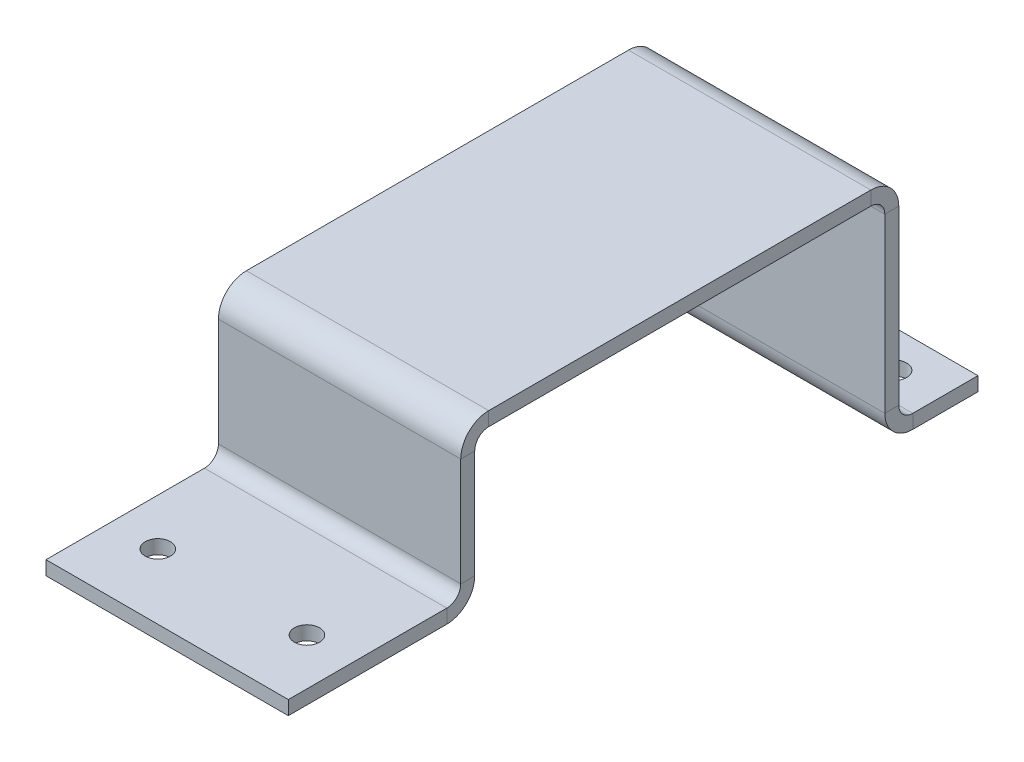
ISO-10303-21;
HEADER;
FILE_DESCRIPTION(('STEP AP214'),'2;1');
FILE_NAME('part.step','',(''),(''),'','','');
FILE_SCHEMA(('AUTOMOTIVE_DESIGN { 1 0 10303 214 1 1 1 1 }'));
ENDSEC;
DATA;
#1=APPLICATION_CONTEXT('core data for automotive mechanical design processes');
#2=APPLICATION_PROTOCOL_DEFINITION('international standard','automotive_design',2000,#1);
#3=PRODUCT_CONTEXT('',#1,'mechanical');
#4=PRODUCT('Part','Part','',(#3));
#5=PRODUCT_RELATED_PRODUCT_CATEGORY('part','',(#4));
#6=PRODUCT_DEFINITION_FORMATION('','',#4);
#7=PRODUCT_DEFINITION_CONTEXT('part definition',#1,'design');
#8=PRODUCT_DEFINITION('design','',#6,#7);
#9=PRODUCT_DEFINITION_SHAPE('','',#8);
#10=(LENGTH_UNIT() NAMED_UNIT(*) SI_UNIT(.MILLI.,.METRE.));
#11=(NAMED_UNIT(*) PLANE_ANGLE_UNIT() SI_UNIT($,.RADIAN.));
#12=(NAMED_UNIT(*) SI_UNIT($,.STERADIAN.) SOLID_ANGLE_UNIT());
#13=UNCERTAINTY_MEASURE_WITH_UNIT(LENGTH_MEASURE(1.E-05),#10,'distance_accuracy_value','');
#14=(GEOMETRIC_REPRESENTATION_CONTEXT(3) GLOBAL_UNCERTAINTY_ASSIGNED_CONTEXT((#13)) GLOBAL_UNIT_ASSIGNED_CONTEXT((#10,
#11,#12)) REPRESENTATION_CONTEXT('',''));
#15=CARTESIAN_POINT('',(0.,0.,0.));
#16=DIRECTION('',(0.,0.,1.));
#17=DIRECTION('',(1.,0.,0.));
#18=AXIS2_PLACEMENT_3D('',#15,#16,#17);
#19=CARTESIAN_POINT('',(0.,6.90000000000016,45.5000000000001));
#20=DIRECTION('',(1.,0.,0.));
#21=DIRECTION('',(0.,0.,-1.));
#22=AXIS2_PLACEMENT_3D('',#19,#20,#21);
#23=PLANE('',#22);
#24=DIRECTION('',(0.,0.,-1.));
#25=VECTOR('',#24,1.);
#26=CARTESIAN_POINT('',(0.,9.90000000000016,45.5000000000001));
#27=LINE('',#26,#25);
#28=CARTESIAN_POINT('',(0.,9.90000000000016,45.5000000000001));
#29=VERTEX_POINT('',#28);
#30=CARTESIAN_POINT('',(0.,9.90000000000017,44.0000000000001));
#31=VERTEX_POINT('',#30);
#32=EDGE_CURVE('E344',#29,#31,#27,.T.);
#33=ORIENTED_EDGE('',*,*,#32,.F.);
#34=DIRECTION('',(0.,-1.,0.));
#35=VECTOR('',#34,1.);
#36=CARTESIAN_POINT('',(0.,3.18995902880593E-13,45.5000000000002));
#37=LINE('',#36,#35);
#38=CARTESIAN_POINT('',(0.,21.5000000000002,45.5));
#39=VERTEX_POINT('',#38);
#40=EDGE_CURVE('E355',#39,#29,#37,.T.);
#41=ORIENTED_EDGE('',*,*,#40,.F.);
#42=DIRECTION('',(0.,0.,-1.));
#43=VECTOR('',#42,1.);
#44=CARTESIAN_POINT('',(0.,21.5000000000002,44.));
#45=LINE('',#44,#43);
#46=CARTESIAN_POINT('',(0.,21.5000000000002,44.));
#47=VERTEX_POINT('',#46);
#48=EDGE_CURVE('E370',#47,#39,#45,.F.);
#49=ORIENTED_EDGE('',*,*,#48,.F.);
#50=DIRECTION('',(0.,1.,0.));
#51=VECTOR('',#50,1.);
#52=CARTESIAN_POINT('',(0.,6.90000000000015,44.0000000000001));
#53=LINE('',#52,#51);
#54=EDGE_CURVE('E362',#47,#31,#53,.F.);
#55=ORIENTED_EDGE('',*,*,#54,.T.);
#56=EDGE_LOOP('',(#33,#41,#49,#55));
#57=FACE_BOUND('',#56,.T.);
#58=ADVANCED_FACE('F128',(#57),#23,.F.);
#59=CARTESIAN_POINT('',(26.,23.0000000000002,45.5));
#60=DIRECTION('',(-1.,0.,0.));
#61=DIRECTION('',(0.,0.,1.));
#62=AXIS2_PLACEMENT_3D('',#59,#60,#61);
#63=PLANE('',#62);
#64=DIRECTION('',(0.,0.,-1.));
#65=VECTOR('',#64,1.);
#66=CARTESIAN_POINT('',(26.,9.90000000000016,45.5000000000001));
#67=LINE('',#66,#65);
#68=CARTESIAN_POINT('',(26.,9.90000000000016,45.5000000000001));
#69=VERTEX_POINT('',#68);
#70=CARTESIAN_POINT('',(26.,9.90000000000015,44.0000000000001));
#71=VERTEX_POINT('',#70);
#72=EDGE_CURVE('E329',#69,#71,#67,.T.);
#73=ORIENTED_EDGE('',*,*,#72,.T.);
#74=DIRECTION('',(0.,-1.,0.));
#75=VECTOR('',#74,1.);
#76=CARTESIAN_POINT('',(26.,23.0000000000002,44.));
#77=LINE('',#76,#75);
#78=CARTESIAN_POINT('',(26.,21.5000000000002,44.));
#79=VERTEX_POINT('',#78);
#80=EDGE_CURVE('E359',#71,#79,#77,.F.);
#81=ORIENTED_EDGE('',*,*,#80,.T.);
#82=DIRECTION('',(0.,0.,-1.));
#83=VECTOR('',#82,1.);
#84=CARTESIAN_POINT('',(26.,21.5000000000002,45.5));
#85=LINE('',#84,#83);
#86=CARTESIAN_POINT('',(26.,21.5000000000002,45.5));
#87=VERTEX_POINT('',#86);
#88=EDGE_CURVE('E347',#79,#87,#85,.F.);
#89=ORIENTED_EDGE('',*,*,#88,.T.);
#90=DIRECTION('',(0.,1.,0.));
#91=VECTOR('',#90,1.);
#92=CARTESIAN_POINT('',(26.,3.18995902880593E-13,45.5000000000002));
#93=LINE('',#92,#91);
#94=EDGE_CURVE('E351',#69,#87,#93,.T.);
#95=ORIENTED_EDGE('',*,*,#94,.F.);
#96=EDGE_LOOP('',(#73,#81,#89,#95));
#97=FACE_BOUND('',#96,.T.);
#98=ADVANCED_FACE('F632',(#97),#63,.F.);
#99=CARTESIAN_POINT('',(0.,3.18995902880593E-13,45.5000000000002));
#100=DIRECTION('',(0.,0.,-1.));
#101=DIRECTION('',(0.,1.,0.));
#102=AXIS2_PLACEMENT_3D('',#99,#100,#101);
#103=PLANE('',#102);
#104=DIRECTION('',(1.,0.,0.));
#105=VECTOR('',#104,1.);
#106=CARTESIAN_POINT('',(26.,9.90000000000016,45.5000000000001));
#107=LINE('',#106,#105);
#108=EDGE_CURVE('E337',#69,#29,#107,.F.);
#109=ORIENTED_EDGE('',*,*,#108,.F.);
#110=ORIENTED_EDGE('',*,*,#94,.T.);
#111=DIRECTION('',(-1.,0.,0.));
#112=VECTOR('',#111,1.);
#113=CARTESIAN_POINT('',(26.,21.5000000000002,45.5));
#114=LINE('',#113,#112);
#115=EDGE_CURVE('E366',#39,#87,#114,.F.);
#116=ORIENTED_EDGE('',*,*,#115,.F.);
#117=ORIENTED_EDGE('',*,*,#40,.T.);
#118=EDGE_LOOP('',(#109,#110,#116,#117));
#119=FACE_BOUND('',#118,.T.);
#120=ADVANCED_FACE('F638',(#119),#103,.F.);
#121=CARTESIAN_POINT('',(0.,3.08497321758376E-13,44.0000000000002));
#122=DIRECTION('',(0.,0.,-1.));
#123=DIRECTION('',(0.,1.,0.));
#124=AXIS2_PLACEMENT_3D('',#121,#122,#123);
#125=PLANE('',#124);
#126=ORIENTED_EDGE('',*,*,#80,.F.);
#127=DIRECTION('',(1.,0.,0.));
#128=VECTOR('',#127,1.);
#129=CARTESIAN_POINT('',(26.,9.90000000000015,44.0000000000001));
#130=LINE('',#129,#128);
#131=EDGE_CURVE('E322',#71,#31,#130,.F.);
#132=ORIENTED_EDGE('',*,*,#131,.T.);
#133=ORIENTED_EDGE('',*,*,#54,.F.);
#134=DIRECTION('',(-1.,0.,0.));
#135=VECTOR('',#134,1.);
#136=CARTESIAN_POINT('',(26.,21.5000000000002,44.));
#137=LINE('',#136,#135);
#138=EDGE_CURVE('E374',#79,#47,#137,.T.);
#139=ORIENTED_EDGE('',*,*,#138,.F.);
#140=EDGE_LOOP('',(#126,#132,#133,#139));
#141=FACE_BOUND('',#140,.T.);
#142=ADVANCED_FACE('F676',(#141),#125,.T.);
#143=CARTESIAN_POINT('',(0.,24.5000000000002,45.5));
#144=DIRECTION('',(1.,0.,0.));
#145=DIRECTION('',(0.,0.,-1.));
#146=AXIS2_PLACEMENT_3D('',#143,#144,#145);
#147=PLANE('',#146);
#148=DIRECTION('',(0.,1.,0.));
#149=VECTOR('',#148,1.);
#150=CARTESIAN_POINT('',(0.,23.0000000000002,42.5));
#151=LINE('',#150,#149);
#152=CARTESIAN_POINT('',(0.,23.0000000000002,42.5));
#153=VERTEX_POINT('',#152);
#154=CARTESIAN_POINT('',(0.,24.5000000000002,42.5));
#155=VERTEX_POINT('',#154);
#156=EDGE_CURVE('E388',#153,#155,#151,.T.);
#157=ORIENTED_EDGE('',*,*,#156,.T.);
#158=DIRECTION('',(0.,0.,1.));
#159=VECTOR('',#158,1.);
#160=CARTESIAN_POINT('',(0.,24.5,0.));
#161=LINE('',#160,#159);
#162=CARTESIAN_POINT('',(0.,24.5,1.49999999999999));
#163=VERTEX_POINT('',#162);
#164=EDGE_CURVE('E413',#163,#155,#161,.T.);
#165=ORIENTED_EDGE('',*,*,#164,.F.);
#166=DIRECTION('',(0.,-1.,0.));
#167=VECTOR('',#166,1.);
#168=CARTESIAN_POINT('',(0.,23.,1.49999999999999));
#169=LINE('',#168,#167);
#170=CARTESIAN_POINT('',(0.,23.,1.49999999999999));
#171=VERTEX_POINT('',#170);
#172=EDGE_CURVE('E426',#171,#163,#169,.F.);
#173=ORIENTED_EDGE('',*,*,#172,.F.);
#174=DIRECTION('',(0.,0.,-1.));
#175=VECTOR('',#174,1.);
#176=CARTESIAN_POINT('',(0.,23.0000000000002,45.5));
#177=LINE('',#176,#175);
#178=EDGE_CURVE('E419',#171,#153,#177,.F.);
#179=ORIENTED_EDGE('',*,*,#178,.T.);
#180=EDGE_LOOP('',(#157,#165,#173,#179));
#181=FACE_BOUND('',#180,.T.);
#182=ADVANCED_FACE('F672',(#181),#147,.F.);
#183=CARTESIAN_POINT('',(26.,24.5,0.));
#184=DIRECTION('',(-1.,0.,0.));
#185=DIRECTION('',(0.,0.,1.));
#186=AXIS2_PLACEMENT_3D('',#183,#184,#185);
#187=PLANE('',#186);
#188=DIRECTION('',(0.,1.,0.));
#189=VECTOR('',#188,1.);
#190=CARTESIAN_POINT('',(26.,23.0000000000002,42.5));
#191=LINE('',#190,#189);
#192=CARTESIAN_POINT('',(26.,23.0000000000002,42.5));
#193=VERTEX_POINT('',#192);
#194=CARTESIAN_POINT('',(26.,24.5000000000002,42.5));
#195=VERTEX_POINT('',#194);
#196=EDGE_CURVE('E401',#193,#195,#191,.T.);
#197=ORIENTED_EDGE('',*,*,#196,.F.);
#198=DIRECTION('',(0.,0.,1.));
#199=VECTOR('',#198,1.);
#200=CARTESIAN_POINT('',(26.,23.,0.));
#201=LINE('',#200,#199);
#202=CARTESIAN_POINT('',(26.,23.,1.49999999999999));
#203=VERTEX_POINT('',#202);
#204=EDGE_CURVE('E416',#193,#203,#201,.F.);
#205=ORIENTED_EDGE('',*,*,#204,.T.);
#206=DIRECTION('',(0.,-1.,0.));
#207=VECTOR('',#206,1.);
#208=CARTESIAN_POINT('',(26.,24.5,1.49999999999999));
#209=LINE('',#208,#207);
#210=CARTESIAN_POINT('',(26.,24.5,1.49999999999999));
#211=VERTEX_POINT('',#210);
#212=EDGE_CURVE('E405',#203,#211,#209,.F.);
#213=ORIENTED_EDGE('',*,*,#212,.T.);
#214=DIRECTION('',(0.,0.,-1.));
#215=VECTOR('',#214,1.);
#216=CARTESIAN_POINT('',(26.,24.5,0.));
#217=LINE('',#216,#215);
#218=EDGE_CURVE('E409',#195,#211,#217,.T.);
#219=ORIENTED_EDGE('',*,*,#218,.F.);
#220=EDGE_LOOP('',(#197,#205,#213,#219));
#221=FACE_BOUND('',#220,.T.);
#222=ADVANCED_FACE('F666',(#221),#187,.F.);
#223=CARTESIAN_POINT('',(0.,24.5,0.));
#224=DIRECTION('',(0.,-1.,0.));
#225=DIRECTION('',(0.,0.,-1.));
#226=AXIS2_PLACEMENT_3D('',#223,#224,#225);
#227=PLANE('',#226);
#228=DIRECTION('',(-1.,0.,0.));
#229=VECTOR('',#228,1.);
#230=CARTESIAN_POINT('',(0.,24.5000000000002,42.5));
#231=LINE('',#230,#229);
#232=EDGE_CURVE('E380',#155,#195,#231,.F.);
#233=ORIENTED_EDGE('',*,*,#232,.T.);
#234=ORIENTED_EDGE('',*,*,#218,.T.);
#235=DIRECTION('',(-1.,0.,0.));
#236=VECTOR('',#235,1.);
#237=CARTESIAN_POINT('',(26.,24.5,1.49999999999999));
#238=LINE('',#237,#236);
#239=EDGE_CURVE('E422',#163,#211,#238,.F.);
#240=ORIENTED_EDGE('',*,*,#239,.F.);
#241=ORIENTED_EDGE('',*,*,#164,.T.);
#242=EDGE_LOOP('',(#233,#234,#240,#241));
#243=FACE_BOUND('',#242,.T.);
#244=ADVANCED_FACE('F662',(#243),#227,.F.);
#245=CARTESIAN_POINT('',(0.,23.,0.));
#246=DIRECTION('',(0.,-1.,0.));
#247=DIRECTION('',(0.,0.,-1.));
#248=AXIS2_PLACEMENT_3D('',#245,#246,#247);
#249=PLANE('',#248);
#250=ORIENTED_EDGE('',*,*,#204,.F.);
#251=DIRECTION('',(-1.,0.,0.));
#252=VECTOR('',#251,1.);
#253=CARTESIAN_POINT('',(0.,23.0000000000002,42.5));
#254=LINE('',#253,#252);
#255=EDGE_CURVE('E152',#153,#193,#254,.F.);
#256=ORIENTED_EDGE('',*,*,#255,.F.);
#257=ORIENTED_EDGE('',*,*,#178,.F.);
#258=DIRECTION('',(-1.,0.,0.));
#259=VECTOR('',#258,1.);
#260=CARTESIAN_POINT('',(26.,23.,1.49999999999999));
#261=LINE('',#260,#259);
#262=EDGE_CURVE('E430',#203,#171,#261,.T.);
#263=ORIENTED_EDGE('',*,*,#262,.F.);
#264=EDGE_LOOP('',(#250,#256,#257,#263));
#265=FACE_BOUND('',#264,.T.);
#266=ADVANCED_FACE('F665',(#265),#249,.T.);
#267=CARTESIAN_POINT('',(26.,24.5,0.));
#268=DIRECTION('',(-1.,0.,0.));
#269=DIRECTION('',(0.,0.,1.));
#270=AXIS2_PLACEMENT_3D('',#267,#268,#269);
#271=PLANE('',#270);
#272=DIRECTION('',(0.,0.,-1.));
#273=VECTOR('',#272,1.);
#274=CARTESIAN_POINT('',(26.,21.5,0.));
#275=LINE('',#274,#273);
#276=CARTESIAN_POINT('',(26.,21.5,0.));
#277=VERTEX_POINT('',#276);
#278=CARTESIAN_POINT('',(26.,21.5,-1.5));
#279=VERTEX_POINT('',#278);
#280=EDGE_CURVE('E459',#277,#279,#275,.T.);
#281=ORIENTED_EDGE('',*,*,#280,.F.);
#282=DIRECTION('',(0.,1.,0.));
#283=VECTOR('',#282,1.);
#284=CARTESIAN_POINT('',(26.,0.,0.));
#285=LINE('',#284,#283);
#286=CARTESIAN_POINT('',(26.,2.99999999999999,0.));
#287=VERTEX_POINT('',#286);
#288=EDGE_CURVE('E471',#287,#277,#285,.T.);
#289=ORIENTED_EDGE('',*,*,#288,.F.);
#290=DIRECTION('',(0.,0.,-1.));
#291=VECTOR('',#290,1.);
#292=CARTESIAN_POINT('',(26.,2.99999999999999,-1.49999999999999));
#293=LINE('',#292,#291);
#294=CARTESIAN_POINT('',(26.,2.99999999999999,-1.5));
#295=VERTEX_POINT('',#294);
#296=EDGE_CURVE('E486',#295,#287,#293,.F.);
#297=ORIENTED_EDGE('',*,*,#296,.F.);
#298=DIRECTION('',(0.,-1.,0.));
#299=VECTOR('',#298,1.);
#300=CARTESIAN_POINT('',(26.,24.5,-1.5));
#301=LINE('',#300,#299);
#302=EDGE_CURVE('E478',#295,#279,#301,.F.);
#303=ORIENTED_EDGE('',*,*,#302,.T.);
#304=EDGE_LOOP('',(#281,#289,#297,#303));
#305=FACE_BOUND('',#304,.T.);
#306=ADVANCED_FACE('F598',(#305),#271,.F.);
#307=CARTESIAN_POINT('',(0.,1.5,0.));
#308=DIRECTION('',(1.,0.,0.));
#309=DIRECTION('',(0.,0.,-1.));
#310=AXIS2_PLACEMENT_3D('',#307,#308,#309);
#311=PLANE('',#310);
#312=DIRECTION('',(0.,0.,-1.));
#313=VECTOR('',#312,1.);
#314=CARTESIAN_POINT('',(0.,21.5,0.));
#315=LINE('',#314,#313);
#316=CARTESIAN_POINT('',(0.,21.5,0.));
#317=VERTEX_POINT('',#316);
#318=CARTESIAN_POINT('',(0.,21.5,-1.5));
#319=VERTEX_POINT('',#318);
#320=EDGE_CURVE('E445',#317,#319,#315,.T.);
#321=ORIENTED_EDGE('',*,*,#320,.T.);
#322=DIRECTION('',(0.,1.,0.));
#323=VECTOR('',#322,1.);
#324=CARTESIAN_POINT('',(0.,1.5,-1.5));
#325=LINE('',#324,#323);
#326=CARTESIAN_POINT('',(0.,2.99999999999999,-1.5));
#327=VERTEX_POINT('',#326);
#328=EDGE_CURVE('E475',#319,#327,#325,.F.);
#329=ORIENTED_EDGE('',*,*,#328,.T.);
#330=DIRECTION('',(0.,0.,-1.));
#331=VECTOR('',#330,1.);
#332=CARTESIAN_POINT('',(0.,2.99999999999999,0.));
#333=LINE('',#332,#331);
#334=CARTESIAN_POINT('',(0.,2.99999999999999,0.));
#335=VERTEX_POINT('',#334);
#336=EDGE_CURVE('E463',#327,#335,#333,.F.);
#337=ORIENTED_EDGE('',*,*,#336,.T.);
#338=DIRECTION('',(0.,-1.,0.));
#339=VECTOR('',#338,1.);
#340=CARTESIAN_POINT('',(0.,0.,0.));
#341=LINE('',#340,#339);
#342=EDGE_CURVE('E467',#317,#335,#341,.T.);
#343=ORIENTED_EDGE('',*,*,#342,.F.);
#344=EDGE_LOOP('',(#321,#329,#337,#343));
#345=FACE_BOUND('',#344,.T.);
#346=ADVANCED_FACE('F615',(#345),#311,.F.);
#347=CARTESIAN_POINT('',(0.,0.,0.));
#348=DIRECTION('',(0.,0.,-1.));
#349=DIRECTION('',(-1.,0.,0.));
#350=AXIS2_PLACEMENT_3D('',#347,#348,#349);
#351=PLANE('',#350);
#352=DIRECTION('',(-1.,0.,0.));
#353=VECTOR('',#352,1.);
#354=CARTESIAN_POINT('',(0.,21.5,0.));
#355=LINE('',#354,#353);
#356=EDGE_CURVE('E453',#317,#277,#355,.F.);
#357=ORIENTED_EDGE('',*,*,#356,.F.);
#358=ORIENTED_EDGE('',*,*,#342,.T.);
#359=DIRECTION('',(1.,0.,0.));
#360=VECTOR('',#359,1.);
#361=CARTESIAN_POINT('',(0.,2.99999999999999,0.));
#362=LINE('',#361,#360);
#363=EDGE_CURVE('E482',#287,#335,#362,.F.);
#364=ORIENTED_EDGE('',*,*,#363,.F.);
#365=ORIENTED_EDGE('',*,*,#288,.T.);
#366=EDGE_LOOP('',(#357,#358,#364,#365));
#367=FACE_BOUND('',#366,.T.);
#368=ADVANCED_FACE('F595',(#367),#351,.F.);
#369=CARTESIAN_POINT('',(0.,0.,-1.5));
#370=DIRECTION('',(0.,0.,-1.));
#371=DIRECTION('',(-1.,0.,0.));
#372=AXIS2_PLACEMENT_3D('',#369,#370,#371);
#373=PLANE('',#372);
#374=ORIENTED_EDGE('',*,*,#328,.F.);
#375=DIRECTION('',(-1.,0.,0.));
#376=VECTOR('',#375,1.);
#377=CARTESIAN_POINT('',(0.,21.5,-1.5));
#378=LINE('',#377,#376);
#379=EDGE_CURVE('E436',#319,#279,#378,.F.);
#380=ORIENTED_EDGE('',*,*,#379,.T.);
#381=ORIENTED_EDGE('',*,*,#302,.F.);
#382=DIRECTION('',(1.,0.,0.));
#383=VECTOR('',#382,1.);
#384=CARTESIAN_POINT('',(0.,2.99999999999999,-1.5));
#385=LINE('',#384,#383);
#386=EDGE_CURVE('E490',#327,#295,#385,.T.);
#387=ORIENTED_EDGE('',*,*,#386,.F.);
#388=EDGE_LOOP('',(#374,#380,#381,#387));
#389=FACE_BOUND('',#388,.T.);
#390=ADVANCED_FACE('F605',(#389),#373,.T.);
#391=CARTESIAN_POINT('',(26.,1.5,0.));
#392=DIRECTION('',(-1.,0.,0.));
#393=DIRECTION('',(0.,0.,-1.));
#394=AXIS2_PLACEMENT_3D('',#391,#392,#393);
#395=PLANE('',#394);
#396=DIRECTION('',(0.,0.,-1.));
#397=VECTOR('',#396,1.);
#398=CARTESIAN_POINT('',(26.,1.5,0.));
#399=LINE('',#398,#397);
#400=CARTESIAN_POINT('',(26.,1.49999999999999,-3.));
#401=VERTEX_POINT('',#400);
#402=CARTESIAN_POINT('',(26.,1.5,-9.99999999999999));
#403=VERTEX_POINT('',#402);
#404=EDGE_CURVE('E531',#401,#403,#399,.T.);
#405=ORIENTED_EDGE('',*,*,#404,.F.);
#406=DIRECTION('',(0.,-1.,0.));
#407=VECTOR('',#406,1.);
#408=CARTESIAN_POINT('',(26.,1.49999999999999,-3.));
#409=LINE('',#408,#407);
#410=CARTESIAN_POINT('',(26.,0.,-3.));
#411=VERTEX_POINT('',#410);
#412=EDGE_CURVE('E505',#401,#411,#409,.T.);
#413=ORIENTED_EDGE('',*,*,#412,.T.);
#414=DIRECTION('',(0.,0.,-1.));
#415=VECTOR('',#414,1.);
#416=CARTESIAN_POINT('',(26.,0.,0.));
#417=LINE('',#416,#415);
#418=CARTESIAN_POINT('',(26.,0.,-9.99999999999999));
#419=VERTEX_POINT('',#418);
#420=EDGE_CURVE('E550',#411,#419,#417,.T.);
#421=ORIENTED_EDGE('',*,*,#420,.T.);
#422=DIRECTION('',(0.,1.,0.));
#423=VECTOR('',#422,1.);
#424=CARTESIAN_POINT('',(26.,1.5,-9.99999999999999));
#425=LINE('',#424,#423);
#426=EDGE_CURVE('E13',#419,#403,#425,.T.);
#427=ORIENTED_EDGE('',*,*,#426,.T.);
#428=EDGE_LOOP('',(#405,#413,#421,#427));
#429=FACE_BOUND('',#428,.T.);
#430=ADVANCED_FACE('F579',(#429),#395,.F.);
#431=CARTESIAN_POINT('',(0.,1.5,0.));
#432=DIRECTION('',(0.,-1.,0.));
#433=DIRECTION('',(0.,0.,-1.));
#434=AXIS2_PLACEMENT_3D('',#431,#432,#433);
#435=PLANE('',#434);
#436=CARTESIAN_POINT('',(21.,1.5,-6.));
#437=DIRECTION('',(0.,1.,0.));
#438=DIRECTION('',(0.,0.,1.));
#439=AXIS2_PLACEMENT_3D('',#436,#437,#438);
#440=CIRCLE('',#439,1.35);
#441=CARTESIAN_POINT('',(21.,1.5,-4.65));
#442=VERTEX_POINT('',#441);
#443=EDGE_CURVE('E543',#442,#442,#440,.T.);
#444=ORIENTED_EDGE('',*,*,#443,.F.);
#445=EDGE_LOOP('',(#444));
#446=FACE_BOUND('',#445,.T.);
#447=CARTESIAN_POINT('',(5.,1.5,-6.));
#448=DIRECTION('',(0.,1.,0.));
#449=DIRECTION('',(0.,0.,1.));
#450=AXIS2_PLACEMENT_3D('',#447,#448,#449);
#451=CIRCLE('',#450,1.35);
#452=CARTESIAN_POINT('',(5.,1.5,-4.65));
#453=VERTEX_POINT('',#452);
#454=EDGE_CURVE('E539',#453,#453,#451,.T.);
#455=ORIENTED_EDGE('',*,*,#454,.F.);
#456=EDGE_LOOP('',(#455));
#457=FACE_BOUND('',#456,.T.);
#458=DIRECTION('',(1.,0.,0.));
#459=VECTOR('',#458,1.);
#460=CARTESIAN_POINT('',(26.,1.49999999999999,-3.));
#461=LINE('',#460,#459);
#462=CARTESIAN_POINT('',(0.,1.49999999999999,-3.));
#463=VERTEX_POINT('',#462);
#464=EDGE_CURVE('E513',#401,#463,#461,.F.);
#465=ORIENTED_EDGE('',*,*,#464,.F.);
#466=ORIENTED_EDGE('',*,*,#404,.T.);
#467=DIRECTION('',(-1.,0.,0.));
#468=VECTOR('',#467,1.);
#469=CARTESIAN_POINT('',(0.,1.5,-9.99999999999999));
#470=LINE('',#469,#468);
#471=CARTESIAN_POINT('',(0.,1.5,-9.99999999999999));
#472=VERTEX_POINT('',#471);
#473=EDGE_CURVE('E535',#403,#472,#470,.T.);
#474=ORIENTED_EDGE('',*,*,#473,.T.);
#475=DIRECTION('',(0.,0.,1.));
#476=VECTOR('',#475,1.);
#477=CARTESIAN_POINT('',(0.,1.5,0.));
#478=LINE('',#477,#476);
#479=EDGE_CURVE('E527',#472,#463,#478,.T.);
#480=ORIENTED_EDGE('',*,*,#479,.T.);
#481=EDGE_LOOP('',(#465,#466,#474,#480));
#482=FACE_BOUND('',#481,.T.);
#483=ADVANCED_FACE('F576',(#446,#457,#482),#435,.F.);
#484=CARTESIAN_POINT('',(0.,0.,0.));
#485=DIRECTION('',(0.,-1.,0.));
#486=DIRECTION('',(0.,0.,-1.));
#487=AXIS2_PLACEMENT_3D('',#484,#485,#486);
#488=PLANE('',#487);
#489=CARTESIAN_POINT('',(5.,0.,-6.));
#490=DIRECTION('',(0.,1.,0.));
#491=DIRECTION('',(0.,0.,1.));
#492=AXIS2_PLACEMENT_3D('',#489,#490,#491);
#493=CIRCLE('',#492,1.35);
#494=CARTESIAN_POINT('',(5.,0.,-4.65));
#495=VERTEX_POINT('',#494);
#496=EDGE_CURVE('E555',#495,#495,#493,.T.);
#497=ORIENTED_EDGE('',*,*,#496,.T.);
#498=EDGE_LOOP('',(#497));
#499=FACE_BOUND('',#498,.T.);
#500=CARTESIAN_POINT('',(21.,0.,-6.));
#501=DIRECTION('',(0.,1.,0.));
#502=DIRECTION('',(0.,0.,1.));
#503=AXIS2_PLACEMENT_3D('',#500,#501,#502);
#504=CIRCLE('',#503,1.35);
#505=CARTESIAN_POINT('',(21.,0.,-4.65));
#506=VERTEX_POINT('',#505);
#507=EDGE_CURVE('E532',#506,#506,#504,.T.);
#508=ORIENTED_EDGE('',*,*,#507,.T.);
#509=EDGE_LOOP('',(#508));
#510=FACE_BOUND('',#509,.T.);
#511=ORIENTED_EDGE('',*,*,#420,.F.);
#512=DIRECTION('',(1.,0.,0.));
#513=VECTOR('',#512,1.);
#514=CARTESIAN_POINT('',(26.,0.,-3.));
#515=LINE('',#514,#513);
#516=CARTESIAN_POINT('',(0.,0.,-3.));
#517=VERTEX_POINT('',#516);
#518=EDGE_CURVE('E496',#411,#517,#515,.F.);
#519=ORIENTED_EDGE('',*,*,#518,.T.);
#520=DIRECTION('',(0.,0.,-1.));
#521=VECTOR('',#520,1.);
#522=CARTESIAN_POINT('',(0.,0.,0.));
#523=LINE('',#522,#521);
#524=CARTESIAN_POINT('',(0.,0.,-9.99999999999999));
#525=VERTEX_POINT('',#524);
#526=EDGE_CURVE('E523',#525,#517,#523,.F.);
#527=ORIENTED_EDGE('',*,*,#526,.F.);
#528=DIRECTION('',(1.,0.,0.));
#529=VECTOR('',#528,1.);
#530=CARTESIAN_POINT('',(0.,0.,-9.99999999999999));
#531=LINE('',#530,#529);
#532=EDGE_CURVE('E551',#419,#525,#531,.F.);
#533=ORIENTED_EDGE('',*,*,#532,.F.);
#534=EDGE_LOOP('',(#511,#519,#527,#533));
#535=FACE_BOUND('',#534,.T.);
#536=ADVANCED_FACE('F582',(#499,#510,#535),#488,.T.);
#537=CARTESIAN_POINT('',(0.,1.5,-9.99999999999999));
#538=DIRECTION('',(0.,0.,1.));
#539=DIRECTION('',(-1.,0.,0.));
#540=AXIS2_PLACEMENT_3D('',#537,#538,#539);
#541=PLANE('',#540);
#542=ORIENTED_EDGE('',*,*,#426,.F.);
#543=ORIENTED_EDGE('',*,*,#532,.T.);
#544=DIRECTION('',(0.,1.,0.));
#545=VECTOR('',#544,1.);
#546=CARTESIAN_POINT('',(0.,1.5,-9.99999999999999));
#547=LINE('',#546,#545);
#548=EDGE_CURVE('E137',#525,#472,#547,.T.);
#549=ORIENTED_EDGE('',*,*,#548,.T.);
#550=ORIENTED_EDGE('',*,*,#473,.F.);
#551=EDGE_LOOP('',(#542,#543,#549,#550));
#552=FACE_BOUND('',#551,.T.);
#553=ADVANCED_FACE('F568',(#552),#541,.F.);
#554=CARTESIAN_POINT('',(0.,1.5,0.));
#555=DIRECTION('',(1.,0.,0.));
#556=DIRECTION('',(0.,0.,1.));
#557=AXIS2_PLACEMENT_3D('',#554,#555,#556);
#558=PLANE('',#557);
#559=DIRECTION('',(0.,-1.,0.));
#560=VECTOR('',#559,1.);
#561=CARTESIAN_POINT('',(0.,1.49999999999999,-3.));
#562=LINE('',#561,#560);
#563=EDGE_CURVE('E519',#463,#517,#562,.T.);
#564=ORIENTED_EDGE('',*,*,#563,.F.);
#565=ORIENTED_EDGE('',*,*,#479,.F.);
#566=ORIENTED_EDGE('',*,*,#548,.F.);
#567=ORIENTED_EDGE('',*,*,#526,.T.);
#568=EDGE_LOOP('',(#564,#565,#566,#567));
#569=FACE_BOUND('',#568,.T.);
#570=ADVANCED_FACE('F573',(#569),#558,.F.);
#571=CARTESIAN_POINT('',(5.,1.5,-6.));
#572=DIRECTION('',(0.,-1.,0.));
#573=DIRECTION('',(0.,0.,-1.));
#574=AXIS2_PLACEMENT_3D('',#571,#572,#573);
#575=CYLINDRICAL_SURFACE('',#574,1.35);
#576=ORIENTED_EDGE('',*,*,#454,.T.);
#577=EDGE_LOOP('',(#576));
#578=FACE_BOUND('',#577,.T.);
#579=ORIENTED_EDGE('',*,*,#496,.F.);
#580=EDGE_LOOP('',(#579));
#581=FACE_BOUND('',#580,.T.);
#582=ADVANCED_FACE('F743',(#578,#581),#575,.F.);
#583=CARTESIAN_POINT('',(21.,1.5,-6.));
#584=DIRECTION('',(0.,-1.,0.));
#585=DIRECTION('',(0.,0.,-1.));
#586=AXIS2_PLACEMENT_3D('',#583,#584,#585);
#587=CYLINDRICAL_SURFACE('',#586,1.35);
#588=ORIENTED_EDGE('',*,*,#443,.T.);
#589=EDGE_LOOP('',(#588));
#590=FACE_BOUND('',#589,.T.);
#591=ORIENTED_EDGE('',*,*,#507,.F.);
#592=EDGE_LOOP('',(#591));
#593=FACE_BOUND('',#592,.T.);
#594=ADVANCED_FACE('F130',(#590,#593),#587,.F.);
#595=CARTESIAN_POINT('',(0.,2.99999999999999,-3.));
#596=DIRECTION('',(-1.,0.,0.));
#597=DIRECTION('',(0.,0.,1.));
#598=AXIS2_PLACEMENT_3D('',#595,#596,#597);
#599=PLANE('',#598);
#600=ORIENTED_EDGE('',*,*,#336,.F.);
#601=CARTESIAN_POINT('',(0.,2.99999999999999,-3.));
#602=DIRECTION('',(1.,0.,0.));
#603=DIRECTION('',(0.,0.,-1.));
#604=AXIS2_PLACEMENT_3D('',#601,#602,#603);
#605=CIRCLE('',#604,1.5);
#606=EDGE_CURVE('E509',#463,#327,#605,.F.);
#607=ORIENTED_EDGE('',*,*,#606,.F.);
#608=ORIENTED_EDGE('',*,*,#563,.T.);
#609=CARTESIAN_POINT('',(0.,2.99999999999999,-3.));
#610=DIRECTION('',(1.,0.,0.));
#611=DIRECTION('',(0.,0.,-1.));
#612=AXIS2_PLACEMENT_3D('',#609,#610,#611);
#613=CIRCLE('',#612,3.);
#614=EDGE_CURVE('E500',#517,#335,#613,.F.);
#615=ORIENTED_EDGE('',*,*,#614,.T.);
#616=EDGE_LOOP('',(#600,#607,#608,#615));
#617=FACE_BOUND('',#616,.T.);
#618=ADVANCED_FACE('F619',(#617),#599,.T.);
#619=CARTESIAN_POINT('',(26.,2.99999999999999,-3.));
#620=DIRECTION('',(-1.,0.,0.));
#621=DIRECTION('',(0.,0.,1.));
#622=AXIS2_PLACEMENT_3D('',#619,#620,#621);
#623=PLANE('',#622);
#624=CARTESIAN_POINT('',(26.,2.99999999999999,-3.));
#625=DIRECTION('',(1.,0.,0.));
#626=DIRECTION('',(0.,0.,-1.));
#627=AXIS2_PLACEMENT_3D('',#624,#625,#626);
#628=CIRCLE('',#627,1.5);
#629=EDGE_CURVE('E470',#295,#401,#628,.T.);
#630=ORIENTED_EDGE('',*,*,#629,.F.);
#631=ORIENTED_EDGE('',*,*,#296,.T.);
#632=CARTESIAN_POINT('',(26.,2.99999999999999,-3.));
#633=DIRECTION('',(1.,0.,0.));
#634=DIRECTION('',(0.,0.,-1.));
#635=AXIS2_PLACEMENT_3D('',#632,#633,#634);
#636=CIRCLE('',#635,3.);
#637=EDGE_CURVE('E501',#287,#411,#636,.T.);
#638=ORIENTED_EDGE('',*,*,#637,.T.);
#639=ORIENTED_EDGE('',*,*,#412,.F.);
#640=EDGE_LOOP('',(#630,#631,#638,#639));
#641=FACE_BOUND('',#640,.T.);
#642=ADVANCED_FACE('F587',(#641),#623,.F.);
#643=CARTESIAN_POINT('',(26.,2.99999999999999,-3.));
#644=DIRECTION('',(1.,0.,0.));
#645=DIRECTION('',(0.,0.,1.));
#646=AXIS2_PLACEMENT_3D('',#643,#644,#645);
#647=CYLINDRICAL_SURFACE('',#646,3.);
#648=ORIENTED_EDGE('',*,*,#518,.F.);
#649=ORIENTED_EDGE('',*,*,#637,.F.);
#650=ORIENTED_EDGE('',*,*,#363,.T.);
#651=ORIENTED_EDGE('',*,*,#614,.F.);
#652=EDGE_LOOP('',(#648,#649,#650,#651));
#653=FACE_BOUND('',#652,.T.);
#654=ADVANCED_FACE('F584',(#653),#647,.T.);
#655=CARTESIAN_POINT('',(26.,2.99999999999999,-3.));
#656=DIRECTION('',(1.,0.,0.));
#657=DIRECTION('',(0.,0.,1.));
#658=AXIS2_PLACEMENT_3D('',#655,#656,#657);
#659=CYLINDRICAL_SURFACE('',#658,1.5);
#660=ORIENTED_EDGE('',*,*,#464,.T.);
#661=ORIENTED_EDGE('',*,*,#606,.T.);
#662=ORIENTED_EDGE('',*,*,#386,.T.);
#663=ORIENTED_EDGE('',*,*,#629,.T.);
#664=EDGE_LOOP('',(#660,#661,#662,#663));
#665=FACE_BOUND('',#664,.T.);
#666=ADVANCED_FACE('F621',(#665),#659,.F.);
#667=CARTESIAN_POINT('',(26.,21.5,1.5));
#668=DIRECTION('',(1.,0.,0.));
#669=DIRECTION('',(0.,0.,-1.));
#670=AXIS2_PLACEMENT_3D('',#667,#668,#669);
#671=PLANE('',#670);
#672=ORIENTED_EDGE('',*,*,#212,.F.);
#673=CARTESIAN_POINT('',(26.,21.5,1.5));
#674=DIRECTION('',(-1.,0.,0.));
#675=DIRECTION('',(0.,0.,1.));
#676=AXIS2_PLACEMENT_3D('',#673,#674,#675);
#677=CIRCLE('',#676,1.5);
#678=EDGE_CURVE('E449',#277,#203,#677,.F.);
#679=ORIENTED_EDGE('',*,*,#678,.F.);
#680=ORIENTED_EDGE('',*,*,#280,.T.);
#681=CARTESIAN_POINT('',(26.,21.5,1.5));
#682=DIRECTION('',(-1.,0.,0.));
#683=DIRECTION('',(0.,0.,1.));
#684=AXIS2_PLACEMENT_3D('',#681,#682,#683);
#685=CIRCLE('',#684,3.);
#686=EDGE_CURVE('E440',#279,#211,#685,.F.);
#687=ORIENTED_EDGE('',*,*,#686,.T.);
#688=EDGE_LOOP('',(#672,#679,#680,#687));
#689=FACE_BOUND('',#688,.T.);
#690=ADVANCED_FACE('F602',(#689),#671,.T.);
#691=CARTESIAN_POINT('',(0.,21.5,1.5));
#692=DIRECTION('',(1.,0.,0.));
#693=DIRECTION('',(0.,0.,-1.));
#694=AXIS2_PLACEMENT_3D('',#691,#692,#693);
#695=PLANE('',#694);
#696=CARTESIAN_POINT('',(0.,21.5,1.5));
#697=DIRECTION('',(-1.,0.,0.));
#698=DIRECTION('',(0.,0.,1.));
#699=AXIS2_PLACEMENT_3D('',#696,#697,#698);
#700=CIRCLE('',#699,1.5);
#701=EDGE_CURVE('E412',#171,#317,#700,.T.);
#702=ORIENTED_EDGE('',*,*,#701,.F.);
#703=ORIENTED_EDGE('',*,*,#172,.T.);
#704=CARTESIAN_POINT('',(0.,21.5,1.5));
#705=DIRECTION('',(-1.,0.,0.));
#706=DIRECTION('',(0.,0.,1.));
#707=AXIS2_PLACEMENT_3D('',#704,#705,#706);
#708=CIRCLE('',#707,3.);
#709=EDGE_CURVE('E441',#163,#319,#708,.T.);
#710=ORIENTED_EDGE('',*,*,#709,.T.);
#711=ORIENTED_EDGE('',*,*,#320,.F.);
#712=EDGE_LOOP('',(#702,#703,#710,#711));
#713=FACE_BOUND('',#712,.T.);
#714=ADVANCED_FACE('F611',(#713),#695,.F.);
#715=CARTESIAN_POINT('',(0.,21.5,1.5));
#716=DIRECTION('',(-1.,0.,0.));
#717=DIRECTION('',(0.,1.,0.));
#718=AXIS2_PLACEMENT_3D('',#715,#716,#717);
#719=CYLINDRICAL_SURFACE('',#718,3.);
#720=ORIENTED_EDGE('',*,*,#379,.F.);
#721=ORIENTED_EDGE('',*,*,#709,.F.);
#722=ORIENTED_EDGE('',*,*,#239,.T.);
#723=ORIENTED_EDGE('',*,*,#686,.F.);
#724=EDGE_LOOP('',(#720,#721,#722,#723));
#725=FACE_BOUND('',#724,.T.);
#726=ADVANCED_FACE('F608',(#725),#719,.T.);
#727=CARTESIAN_POINT('',(0.,21.5,1.5));
#728=DIRECTION('',(-1.,0.,0.));
#729=DIRECTION('',(0.,1.,0.));
#730=AXIS2_PLACEMENT_3D('',#727,#728,#729);
#731=CYLINDRICAL_SURFACE('',#730,1.5);
#732=ORIENTED_EDGE('',*,*,#356,.T.);
#733=ORIENTED_EDGE('',*,*,#678,.T.);
#734=ORIENTED_EDGE('',*,*,#262,.T.);
#735=ORIENTED_EDGE('',*,*,#701,.T.);
#736=EDGE_LOOP('',(#732,#733,#734,#735));
#737=FACE_BOUND('',#736,.T.);
#738=ADVANCED_FACE('F657',(#737),#731,.F.);
#739=CARTESIAN_POINT('',(26.,21.5000000000002,42.5));
#740=DIRECTION('',(1.,0.,0.));
#741=DIRECTION('',(0.,0.,-1.));
#742=AXIS2_PLACEMENT_3D('',#739,#740,#741);
#743=PLANE('',#742);
#744=ORIENTED_EDGE('',*,*,#88,.F.);
#745=CARTESIAN_POINT('',(26.,21.5000000000002,42.5));
#746=DIRECTION('',(-1.,0.,0.));
#747=DIRECTION('',(0.,0.,1.));
#748=AXIS2_PLACEMENT_3D('',#745,#746,#747);
#749=CIRCLE('',#748,1.5);
#750=EDGE_CURVE('E392',#193,#79,#749,.F.);
#751=ORIENTED_EDGE('',*,*,#750,.F.);
#752=ORIENTED_EDGE('',*,*,#196,.T.);
#753=CARTESIAN_POINT('',(26.,21.5000000000002,42.5));
#754=DIRECTION('',(-1.,0.,0.));
#755=DIRECTION('',(0.,0.,1.));
#756=AXIS2_PLACEMENT_3D('',#753,#754,#755);
#757=CIRCLE('',#756,3.);
#758=EDGE_CURVE('E383',#195,#87,#757,.F.);
#759=ORIENTED_EDGE('',*,*,#758,.T.);
#760=EDGE_LOOP('',(#744,#751,#752,#759));
#761=FACE_BOUND('',#760,.T.);
#762=ADVANCED_FACE('F654',(#761),#743,.T.);
#763=CARTESIAN_POINT('',(0.,21.5000000000002,42.5));
#764=DIRECTION('',(1.,0.,0.));
#765=DIRECTION('',(0.,0.,-1.));
#766=AXIS2_PLACEMENT_3D('',#763,#764,#765);
#767=PLANE('',#766);
#768=CARTESIAN_POINT('',(0.,21.5000000000002,42.5));
#769=DIRECTION('',(-1.,0.,0.));
#770=DIRECTION('',(0.,0.,1.));
#771=AXIS2_PLACEMENT_3D('',#768,#769,#770);
#772=CIRCLE('',#771,1.5);
#773=EDGE_CURVE('E354',#47,#153,#772,.T.);
#774=ORIENTED_EDGE('',*,*,#773,.F.);
#775=ORIENTED_EDGE('',*,*,#48,.T.);
#776=CARTESIAN_POINT('',(0.,21.5000000000002,42.5));
#777=DIRECTION('',(-1.,0.,0.));
#778=DIRECTION('',(0.,0.,1.));
#779=AXIS2_PLACEMENT_3D('',#776,#777,#778);
#780=CIRCLE('',#779,3.);
#781=EDGE_CURVE('E384',#39,#155,#780,.T.);
#782=ORIENTED_EDGE('',*,*,#781,.T.);
#783=ORIENTED_EDGE('',*,*,#156,.F.);
#784=EDGE_LOOP('',(#774,#775,#782,#783));
#785=FACE_BOUND('',#784,.T.);
#786=ADVANCED_FACE('F648',(#785),#767,.F.);
#787=CARTESIAN_POINT('',(0.,21.5000000000002,42.5));
#788=DIRECTION('',(-1.,0.,0.));
#789=DIRECTION('',(0.,0.,1.));
#790=AXIS2_PLACEMENT_3D('',#787,#788,#789);
#791=CYLINDRICAL_SURFACE('',#790,3.);
#792=ORIENTED_EDGE('',*,*,#232,.F.);
#793=ORIENTED_EDGE('',*,*,#781,.F.);
#794=ORIENTED_EDGE('',*,*,#115,.T.);
#795=ORIENTED_EDGE('',*,*,#758,.F.);
#796=EDGE_LOOP('',(#792,#793,#794,#795));
#797=FACE_BOUND('',#796,.T.);
#798=ADVANCED_FACE('F644',(#797),#791,.T.);
#799=CARTESIAN_POINT('',(0.,21.5000000000002,42.5));
#800=DIRECTION('',(-1.,0.,0.));
#801=DIRECTION('',(0.,0.,1.));
#802=AXIS2_PLACEMENT_3D('',#799,#800,#801);
#803=CYLINDRICAL_SURFACE('',#802,1.5);
#804=ORIENTED_EDGE('',*,*,#255,.T.);
#805=ORIENTED_EDGE('',*,*,#750,.T.);
#806=ORIENTED_EDGE('',*,*,#138,.T.);
#807=ORIENTED_EDGE('',*,*,#773,.T.);
#808=EDGE_LOOP('',(#804,#805,#806,#807));
#809=FACE_BOUND('',#808,.T.);
#810=ADVANCED_FACE('F647',(#809),#803,.F.);
#811=CARTESIAN_POINT('',(0.,9.90000000000017,47.0000000000001));
#812=DIRECTION('',(-1.,0.,0.));
#813=DIRECTION('',(0.,0.,1.));
#814=AXIS2_PLACEMENT_3D('',#811,#812,#813);
#815=PLANE('',#814);
#816=DIRECTION('',(0.,1.,0.));
#817=VECTOR('',#816,1.);
#818=CARTESIAN_POINT('',(0.,6.90000000000017,47.0000000000001));
#819=LINE('',#818,#817);
#820=CARTESIAN_POINT('',(0.,8.40000000000017,47.0000000000001));
#821=VERTEX_POINT('',#820);
#822=CARTESIAN_POINT('',(0.,6.90000000000017,47.0000000000001));
#823=VERTEX_POINT('',#822);
#824=EDGE_CURVE('E294',#821,#823,#819,.F.);
#825=ORIENTED_EDGE('',*,*,#824,.F.);
#826=CARTESIAN_POINT('',(0.,9.90000000000017,47.0000000000001));
#827=DIRECTION('',(1.,0.,0.));
#828=DIRECTION('',(0.,0.,-1.));
#829=AXIS2_PLACEMENT_3D('',#826,#827,#828);
#830=CIRCLE('',#829,1.5);
#831=EDGE_CURVE('E333',#29,#821,#830,.F.);
#832=ORIENTED_EDGE('',*,*,#831,.F.);
#833=ORIENTED_EDGE('',*,*,#32,.T.);
#834=CARTESIAN_POINT('',(0.,9.90000000000017,47.0000000000001));
#835=DIRECTION('',(1.,0.,0.));
#836=DIRECTION('',(0.,0.,-1.));
#837=AXIS2_PLACEMENT_3D('',#834,#835,#836);
#838=CIRCLE('',#837,3.);
#839=EDGE_CURVE('E144',#31,#823,#838,.F.);
#840=ORIENTED_EDGE('',*,*,#839,.T.);
#841=EDGE_LOOP('',(#825,#832,#833,#840));
#842=FACE_BOUND('',#841,.T.);
#843=ADVANCED_FACE('F652',(#842),#815,.T.);
#844=CARTESIAN_POINT('',(26.,9.90000000000017,47.0000000000001));
#845=DIRECTION('',(-1.,0.,0.));
#846=DIRECTION('',(0.,0.,1.));
#847=AXIS2_PLACEMENT_3D('',#844,#845,#846);
#848=PLANE('',#847);
#849=CARTESIAN_POINT('',(26.,9.90000000000017,47.0000000000001));
#850=DIRECTION('',(1.,0.,0.));
#851=DIRECTION('',(0.,0.,-1.));
#852=AXIS2_PLACEMENT_3D('',#849,#850,#851);
#853=CIRCLE('',#852,1.5);
#854=CARTESIAN_POINT('',(26.,8.40000000000017,47.0000000000001));
#855=VERTEX_POINT('',#854);
#856=EDGE_CURVE('E340',#855,#69,#853,.T.);
#857=ORIENTED_EDGE('',*,*,#856,.F.);
#858=DIRECTION('',(0.,1.,0.));
#859=VECTOR('',#858,1.);
#860=CARTESIAN_POINT('',(26.,8.40000000000016,47.0000000000001));
#861=LINE('',#860,#859);
#862=CARTESIAN_POINT('',(26.,6.90000000000017,47.0000000000001));
#863=VERTEX_POINT('',#862);
#864=EDGE_CURVE('E312',#855,#863,#861,.F.);
#865=ORIENTED_EDGE('',*,*,#864,.T.);
#866=CARTESIAN_POINT('',(26.,9.90000000000017,47.0000000000001));
#867=DIRECTION('',(1.,0.,0.));
#868=DIRECTION('',(0.,0.,-1.));
#869=AXIS2_PLACEMENT_3D('',#866,#867,#868);
#870=CIRCLE('',#869,3.);
#871=EDGE_CURVE('E326',#863,#71,#870,.T.);
#872=ORIENTED_EDGE('',*,*,#871,.T.);
#873=ORIENTED_EDGE('',*,*,#72,.F.);
#874=EDGE_LOOP('',(#857,#865,#872,#873));
#875=FACE_BOUND('',#874,.T.);
#876=ADVANCED_FACE('F925',(#875),#848,.F.);
#877=CARTESIAN_POINT('',(26.,9.90000000000017,47.0000000000001));
#878=DIRECTION('',(1.,0.,0.));
#879=DIRECTION('',(0.,-1.,0.));
#880=AXIS2_PLACEMENT_3D('',#877,#878,#879);
#881=CYLINDRICAL_SURFACE('',#880,3.);
#882=ORIENTED_EDGE('',*,*,#131,.F.);
#883=ORIENTED_EDGE('',*,*,#871,.F.);
#884=DIRECTION('',(1.,0.,0.));
#885=VECTOR('',#884,1.);
#886=CARTESIAN_POINT('',(0.,6.90000000000017,47.0000000000001));
#887=LINE('',#886,#885);
#888=EDGE_CURVE('E309',#863,#823,#887,.F.);
#889=ORIENTED_EDGE('',*,*,#888,.T.);
#890=ORIENTED_EDGE('',*,*,#839,.F.);
#891=EDGE_LOOP('',(#882,#883,#889,#890));
#892=FACE_BOUND('',#891,.T.);
#893=ADVANCED_FACE('F938',(#892),#881,.T.);
#894=CARTESIAN_POINT('',(26.,9.90000000000017,47.0000000000001));
#895=DIRECTION('',(1.,0.,0.));
#896=DIRECTION('',(0.,-1.,0.));
#897=AXIS2_PLACEMENT_3D('',#894,#895,#896);
#898=CYLINDRICAL_SURFACE('',#897,1.5);
#899=ORIENTED_EDGE('',*,*,#108,.T.);
#900=ORIENTED_EDGE('',*,*,#831,.T.);
#901=DIRECTION('',(1.,0.,0.));
#902=VECTOR('',#901,1.);
#903=CARTESIAN_POINT('',(0.,8.40000000000017,47.0000000000001));
#904=LINE('',#903,#902);
#905=EDGE_CURVE('E316',#821,#855,#904,.T.);
#906=ORIENTED_EDGE('',*,*,#905,.T.);
#907=ORIENTED_EDGE('',*,*,#856,.T.);
#908=EDGE_LOOP('',(#899,#900,#906,#907));
#909=FACE_BOUND('',#908,.T.);
#910=ADVANCED_FACE('F950',(#909),#898,.F.);
#911=CARTESIAN_POINT('',(26.,6.90000000000023,64.0000000000001));
#912=DIRECTION('',(-1.,0.,0.));
#913=DIRECTION('',(0.,-1.,0.));
#914=AXIS2_PLACEMENT_3D('',#911,#912,#913);
#915=PLANE('',#914);
#916=ORIENTED_EDGE('',*,*,#864,.F.);
#917=DIRECTION('',(0.,0.,-1.));
#918=VECTOR('',#917,1.);
#919=CARTESIAN_POINT('',(26.,8.40000000000023,64.0000000000001));
#920=LINE('',#919,#918);
#921=CARTESIAN_POINT('',(26.,8.40000000000023,64.0000000000001));
#922=VERTEX_POINT('',#921);
#923=EDGE_CURVE('E306',#855,#922,#920,.F.);
#924=ORIENTED_EDGE('',*,*,#923,.T.);
#925=DIRECTION('',(0.,1.,0.));
#926=VECTOR('',#925,1.);
#927=CARTESIAN_POINT('',(26.,6.90000000000023,64.0000000000001));
#928=LINE('',#927,#926);
#929=CARTESIAN_POINT('',(26.,6.90000000000023,64.0000000000001));
#930=VERTEX_POINT('',#929);
#931=EDGE_CURVE('E290',#930,#922,#928,.T.);
#932=ORIENTED_EDGE('',*,*,#931,.F.);
#933=DIRECTION('',(0.,0.,1.));
#934=VECTOR('',#933,1.);
#935=CARTESIAN_POINT('',(26.,6.90000000000001,0.));
#936=LINE('',#935,#934);
#937=EDGE_CURVE('E275',#863,#930,#936,.T.);
#938=ORIENTED_EDGE('',*,*,#937,.F.);
#939=EDGE_LOOP('',(#916,#924,#932,#938));
#940=FACE_BOUND('',#939,.T.);
#941=ADVANCED_FACE('F961',(#940),#915,.F.);
#942=CARTESIAN_POINT('',(0.,6.90000000000016,45.5000000000001));
#943=DIRECTION('',(1.,0.,0.));
#944=DIRECTION('',(0.,1.,0.));
#945=AXIS2_PLACEMENT_3D('',#942,#943,#944);
#946=PLANE('',#945);
#947=ORIENTED_EDGE('',*,*,#824,.T.);
#948=DIRECTION('',(0.,0.,-1.));
#949=VECTOR('',#948,1.);
#950=CARTESIAN_POINT('',(0.,6.90000000000001,0.));
#951=LINE('',#950,#949);
#952=CARTESIAN_POINT('',(0.,6.90000000000023,64.0000000000001));
#953=VERTEX_POINT('',#952);
#954=EDGE_CURVE('E273',#953,#823,#951,.T.);
#955=ORIENTED_EDGE('',*,*,#954,.F.);
#956=DIRECTION('',(0.,1.,0.));
#957=VECTOR('',#956,1.);
#958=CARTESIAN_POINT('',(0.,6.90000000000023,64.0000000000001));
#959=LINE('',#958,#957);
#960=CARTESIAN_POINT('',(0.,8.40000000000023,64.0000000000001));
#961=VERTEX_POINT('',#960);
#962=EDGE_CURVE('E282',#953,#961,#959,.T.);
#963=ORIENTED_EDGE('',*,*,#962,.T.);
#964=DIRECTION('',(0.,0.,1.));
#965=VECTOR('',#964,1.);
#966=CARTESIAN_POINT('',(0.,8.40000000000016,45.5000000000001));
#967=LINE('',#966,#965);
#968=EDGE_CURVE('E301',#961,#821,#967,.F.);
#969=ORIENTED_EDGE('',*,*,#968,.T.);
#970=EDGE_LOOP('',(#947,#955,#963,#969));
#971=FACE_BOUND('',#970,.T.);
#972=ADVANCED_FACE('F293',(#971),#946,.F.);
#973=CARTESIAN_POINT('',(0.,6.90000000000001,0.));
#974=DIRECTION('',(0.,1.,0.));
#975=DIRECTION('',(0.,0.,1.));
#976=AXIS2_PLACEMENT_3D('',#973,#974,#975);
#977=PLANE('',#976);
#978=CARTESIAN_POINT('',(5.,6.9000000000002,57.0000000000001));
#979=DIRECTION('',(0.,1.,0.));
#980=DIRECTION('',(0.,0.,1.));
#981=AXIS2_PLACEMENT_3D('',#978,#979,#980);
#982=CIRCLE('',#981,1.35);
#983=CARTESIAN_POINT('',(5.,6.90000000000021,58.3500000000001));
#984=VERTEX_POINT('',#983);
#985=EDGE_CURVE('E321',#984,#984,#982,.T.);
#986=ORIENTED_EDGE('',*,*,#985,.T.);
#987=EDGE_LOOP('',(#986));
#988=FACE_BOUND('',#987,.T.);
#989=CARTESIAN_POINT('',(21.,6.9000000000002,57.0000000000001));
#990=DIRECTION('',(0.,1.,0.));
#991=DIRECTION('',(0.,0.,1.));
#992=AXIS2_PLACEMENT_3D('',#989,#990,#991);
#993=CIRCLE('',#992,1.35);
#994=CARTESIAN_POINT('',(21.,6.90000000000021,58.3500000000001));
#995=VERTEX_POINT('',#994);
#996=EDGE_CURVE('E1198',#995,#995,#993,.T.);
#997=ORIENTED_EDGE('',*,*,#996,.T.);
#998=EDGE_LOOP('',(#997));
#999=FACE_BOUND('',#998,.T.);
#1000=ORIENTED_EDGE('',*,*,#888,.F.);
#1001=ORIENTED_EDGE('',*,*,#937,.T.);
#1002=DIRECTION('',(-1.,0.,0.));
#1003=VECTOR('',#1002,1.);
#1004=CARTESIAN_POINT('',(0.,6.90000000000023,64.0000000000001));
#1005=LINE('',#1004,#1003);
#1006=EDGE_CURVE('E268',#930,#953,#1005,.T.);
#1007=ORIENTED_EDGE('',*,*,#1006,.T.);
#1008=ORIENTED_EDGE('',*,*,#954,.T.);
#1009=EDGE_LOOP('',(#1000,#1001,#1007,#1008));
#1010=FACE_BOUND('',#1009,.T.);
#1011=ADVANCED_FACE('F271',(#988,#999,#1010),#977,.F.);
#1012=CARTESIAN_POINT('',(0.,8.40000000000001,0.));
#1013=DIRECTION('',(0.,1.,0.));
#1014=DIRECTION('',(0.,0.,1.));
#1015=AXIS2_PLACEMENT_3D('',#1012,#1013,#1014);
#1016=PLANE('',#1015);
#1017=CARTESIAN_POINT('',(5.,8.4000000000002,57.0000000000001));
#1018=DIRECTION('',(0.,1.,0.));
#1019=DIRECTION('',(0.,0.,1.));
#1020=AXIS2_PLACEMENT_3D('',#1017,#1018,#1019);
#1021=CIRCLE('',#1020,1.35);
#1022=CARTESIAN_POINT('',(5.,8.40000000000021,58.3500000000001));
#1023=VERTEX_POINT('',#1022);
#1024=EDGE_CURVE('E1190',#1023,#1023,#1021,.T.);
#1025=ORIENTED_EDGE('',*,*,#1024,.F.);
#1026=EDGE_LOOP('',(#1025));
#1027=FACE_BOUND('',#1026,.T.);
#1028=CARTESIAN_POINT('',(21.,8.4000000000002,57.0000000000001));
#1029=DIRECTION('',(0.,1.,0.));
#1030=DIRECTION('',(0.,0.,1.));
#1031=AXIS2_PLACEMENT_3D('',#1028,#1029,#1030);
#1032=CIRCLE('',#1031,1.35);
#1033=CARTESIAN_POINT('',(21.,8.40000000000021,58.3500000000001));
#1034=VERTEX_POINT('',#1033);
#1035=EDGE_CURVE('E1192',#1034,#1034,#1032,.T.);
#1036=ORIENTED_EDGE('',*,*,#1035,.F.);
#1037=EDGE_LOOP('',(#1036));
#1038=FACE_BOUND('',#1037,.T.);
#1039=ORIENTED_EDGE('',*,*,#923,.F.);
#1040=ORIENTED_EDGE('',*,*,#905,.F.);
#1041=ORIENTED_EDGE('',*,*,#968,.F.);
#1042=DIRECTION('',(1.,0.,0.));
#1043=VECTOR('',#1042,1.);
#1044=CARTESIAN_POINT('',(0.,8.40000000000023,64.0000000000001));
#1045=LINE('',#1044,#1043);
#1046=EDGE_CURVE('E285',#922,#961,#1045,.F.);
#1047=ORIENTED_EDGE('',*,*,#1046,.F.);
#1048=EDGE_LOOP('',(#1039,#1040,#1041,#1047));
#1049=FACE_BOUND('',#1048,.T.);
#1050=ADVANCED_FACE('F995',(#1027,#1038,#1049),#1016,.T.);
#1051=CARTESIAN_POINT('',(0.,6.90000000000023,64.0000000000001));
#1052=DIRECTION('',(0.,0.,-1.));
#1053=DIRECTION('',(0.,1.,0.));
#1054=AXIS2_PLACEMENT_3D('',#1051,#1052,#1053);
#1055=PLANE('',#1054);
#1056=ORIENTED_EDGE('',*,*,#1046,.T.);
#1057=ORIENTED_EDGE('',*,*,#962,.F.);
#1058=ORIENTED_EDGE('',*,*,#1006,.F.);
#1059=ORIENTED_EDGE('',*,*,#931,.T.);
#1060=EDGE_LOOP('',(#1056,#1057,#1058,#1059));
#1061=FACE_BOUND('',#1060,.T.);
#1062=ADVANCED_FACE('F283',(#1061),#1055,.F.);
#1063=CARTESIAN_POINT('',(21.,6.9000000000002,57.0000000000001));
#1064=DIRECTION('',(0.,1.,0.));
#1065=DIRECTION('',(0.,0.,1.));
#1066=AXIS2_PLACEMENT_3D('',#1063,#1064,#1065);
#1067=CYLINDRICAL_SURFACE('',#1066,1.35);
#1068=ORIENTED_EDGE('',*,*,#996,.F.);
#1069=EDGE_LOOP('',(#1068));
#1070=FACE_BOUND('',#1069,.T.);
#1071=ORIENTED_EDGE('',*,*,#1035,.T.);
#1072=EDGE_LOOP('',(#1071));
#1073=FACE_BOUND('',#1072,.T.);
#1074=ADVANCED_FACE('F1018',(#1070,#1073),#1067,.F.);
#1075=CARTESIAN_POINT('',(5.,6.9000000000002,57.0000000000001));
#1076=DIRECTION('',(0.,1.,0.));
#1077=DIRECTION('',(0.,0.,1.));
#1078=AXIS2_PLACEMENT_3D('',#1075,#1076,#1077);
#1079=CYLINDRICAL_SURFACE('',#1078,1.35);
#1080=ORIENTED_EDGE('',*,*,#985,.F.);
#1081=EDGE_LOOP('',(#1080));
#1082=FACE_BOUND('',#1081,.T.);
#1083=ORIENTED_EDGE('',*,*,#1024,.T.);
#1084=EDGE_LOOP('',(#1083));
#1085=FACE_BOUND('',#1084,.T.);
#1086=ADVANCED_FACE('F1028',(#1082,#1085),#1079,.F.);
#1087=CLOSED_SHELL('',(#58,#98,#120,#142,#182,#222,#244,#266,#306,#346,#368,#390,#430,#483,#536,
#553,#570,#582,#594,#618,#642,#654,#666,#690,#714,#726,#738,#762,#786,#798,#810,#843,#876,#893,
#910,#941,#972,#1011,#1050,#1062,#1074,#1086));
#1088=MANIFOLD_SOLID_BREP('B2',#1087);
#1089=ADVANCED_BREP_SHAPE_REPRESENTATION('',(#18,#1088),#14);
#1090=SHAPE_DEFINITION_REPRESENTATION(#9,#1089);
ENDSEC;
END-ISO-10303-21;
